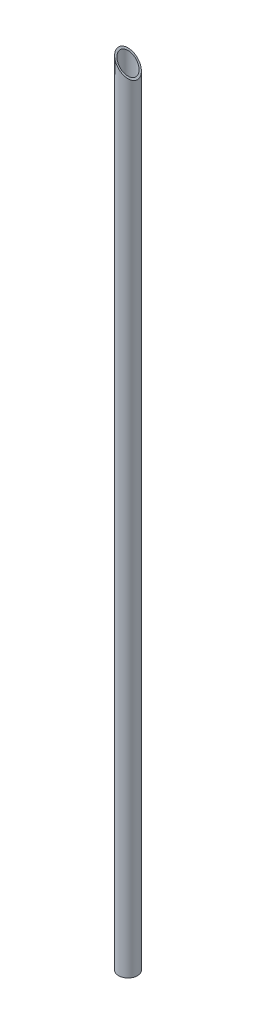
ISO-10303-21;
HEADER;
FILE_DESCRIPTION(('STEP AP214'),'2;1');
FILE_NAME('part.step','',(''),(''),'','','');
FILE_SCHEMA(('AUTOMOTIVE_DESIGN { 1 0 10303 214 1 1 1 1 }'));
ENDSEC;
DATA;
#1=APPLICATION_CONTEXT('core data for automotive mechanical design processes');
#2=APPLICATION_PROTOCOL_DEFINITION('international standard','automotive_design',2000,#1);
#3=PRODUCT_CONTEXT('',#1,'mechanical');
#4=PRODUCT('Part','Part','',(#3));
#5=PRODUCT_RELATED_PRODUCT_CATEGORY('part','',(#4));
#6=PRODUCT_DEFINITION_FORMATION('','',#4);
#7=PRODUCT_DEFINITION_CONTEXT('part definition',#1,'design');
#8=PRODUCT_DEFINITION('design','',#6,#7);
#9=PRODUCT_DEFINITION_SHAPE('','',#8);
#10=(LENGTH_UNIT() NAMED_UNIT(*) SI_UNIT(.MILLI.,.METRE.));
#11=(NAMED_UNIT(*) PLANE_ANGLE_UNIT() SI_UNIT($,.RADIAN.));
#12=(NAMED_UNIT(*) SI_UNIT($,.STERADIAN.) SOLID_ANGLE_UNIT());
#13=UNCERTAINTY_MEASURE_WITH_UNIT(LENGTH_MEASURE(1.E-05),#10,'distance_accuracy_value','');
#14=(GEOMETRIC_REPRESENTATION_CONTEXT(3) GLOBAL_UNCERTAINTY_ASSIGNED_CONTEXT((#13)) GLOBAL_UNIT_ASSIGNED_CONTEXT((#10,
#11,#12)) REPRESENTATION_CONTEXT('',''));
#15=CARTESIAN_POINT('',(0.,0.,0.));
#16=DIRECTION('',(0.,0.,1.));
#17=DIRECTION('',(1.,0.,0.));
#18=AXIS2_PLACEMENT_3D('',#15,#16,#17);
#19=CARTESIAN_POINT('',(0.,-885.825,0.));
#20=DIRECTION('',(0.,1.,0.));
#21=DIRECTION('',(0.,0.,1.));
#22=AXIS2_PLACEMENT_3D('',#19,#20,#21);
#23=CYLINDRICAL_SURFACE('',#22,17.526);
#24=CARTESIAN_POINT('',(0.,-885.825,0.));
#25=DIRECTION('',(0.,1.,0.));
#26=DIRECTION('',(0.,0.,1.));
#27=AXIS2_PLACEMENT_3D('',#24,#25,#26);
#28=CIRCLE('',#27,17.526);
#29=CARTESIAN_POINT('',(0.,-885.825,17.526));
#30=VERTEX_POINT('',#29);
#31=EDGE_CURVE('E18',#30,#30,#28,.F.);
#32=ORIENTED_EDGE('',*,*,#31,.T.);
#33=EDGE_LOOP('',(#32));
#34=FACE_BOUND('',#33,.T.);
#35=CARTESIAN_POINT('',(0.,864.743,0.));
#36=DIRECTION('',(-0.707106781186548,-0.707106781186548,0.));
#37=DIRECTION('',(-0.707106781186548,0.707106781186548,0.));
#38=AXIS2_PLACEMENT_3D('',#35,#36,#37);
#39=ELLIPSE('',#38,24.7855068941509,17.526);
#40=CARTESIAN_POINT('',(-17.526,882.269,0.));
#41=VERTEX_POINT('',#40);
#42=EDGE_CURVE('E27',#41,#41,#39,.F.);
#43=ORIENTED_EDGE('',*,*,#42,.T.);
#44=EDGE_LOOP('',(#43));
#45=FACE_BOUND('',#44,.T.);
#46=ADVANCED_FACE('F15',(#34,#45),#23,.F.);
#47=CARTESIAN_POINT('',(0.,-885.825,0.));
#48=DIRECTION('',(0.,1.,0.));
#49=DIRECTION('',(0.,0.,1.));
#50=AXIS2_PLACEMENT_3D('',#47,#48,#49);
#51=PLANE('',#50);
#52=ORIENTED_EDGE('',*,*,#31,.F.);
#53=EDGE_LOOP('',(#52));
#54=FACE_BOUND('',#53,.T.);
#55=CARTESIAN_POINT('',(0.,-885.825,0.));
#56=DIRECTION('',(0.,1.,0.));
#57=DIRECTION('',(0.,0.,1.));
#58=AXIS2_PLACEMENT_3D('',#55,#56,#57);
#59=CIRCLE('',#58,21.082);
#60=CARTESIAN_POINT('',(0.,-885.825,21.082));
#61=VERTEX_POINT('',#60);
#62=EDGE_CURVE('E22',#61,#61,#59,.T.);
#63=ORIENTED_EDGE('',*,*,#62,.F.);
#64=EDGE_LOOP('',(#63));
#65=FACE_BOUND('',#64,.T.);
#66=ADVANCED_FACE('F36',(#54,#65),#51,.F.);
#67=CARTESIAN_POINT('',(-21.082,885.825,-25.2984));
#68=DIRECTION('',(-0.707106781186548,-0.707106781186548,0.));
#69=DIRECTION('',(0.707106781186548,-0.707106781186548,0.));
#70=AXIS2_PLACEMENT_3D('',#67,#68,#69);
#71=PLANE('',#70);
#72=ORIENTED_EDGE('',*,*,#42,.F.);
#73=EDGE_LOOP('',(#72));
#74=FACE_BOUND('',#73,.T.);
#75=CARTESIAN_POINT('',(0.,864.743,0.));
#76=DIRECTION('',(-0.707106781186548,-0.707106781186548,0.));
#77=DIRECTION('',(-0.707106781186548,0.707106781186548,0.));
#78=AXIS2_PLACEMENT_3D('',#75,#76,#77);
#79=ELLIPSE('',#78,29.8144503219496,21.082);
#80=CARTESIAN_POINT('',(-21.082,885.825,0.));
#81=VERTEX_POINT('',#80);
#82=EDGE_CURVE('E10',#81,#81,#79,.T.);
#83=ORIENTED_EDGE('',*,*,#82,.F.);
#84=EDGE_LOOP('',(#83));
#85=FACE_BOUND('',#84,.T.);
#86=ADVANCED_FACE('F39',(#74,#85),#71,.F.);
#87=CARTESIAN_POINT('',(0.,-885.825,0.));
#88=DIRECTION('',(0.,1.,0.));
#89=DIRECTION('',(0.,0.,1.));
#90=AXIS2_PLACEMENT_3D('',#87,#88,#89);
#91=CYLINDRICAL_SURFACE('',#90,21.082);
#92=ORIENTED_EDGE('',*,*,#62,.T.);
#93=EDGE_LOOP('',(#92));
#94=FACE_BOUND('',#93,.T.);
#95=ORIENTED_EDGE('',*,*,#82,.T.);
#96=EDGE_LOOP('',(#95));
#97=FACE_BOUND('',#96,.T.);
#98=ADVANCED_FACE('F42',(#94,#97),#91,.T.);
#99=CLOSED_SHELL('',(#46,#66,#86,#98));
#100=MANIFOLD_SOLID_BREP('B1',#99);
#101=ADVANCED_BREP_SHAPE_REPRESENTATION('',(#18,#100),#14);
#102=SHAPE_DEFINITION_REPRESENTATION(#9,#101);
ENDSEC;
END-ISO-10303-21;
